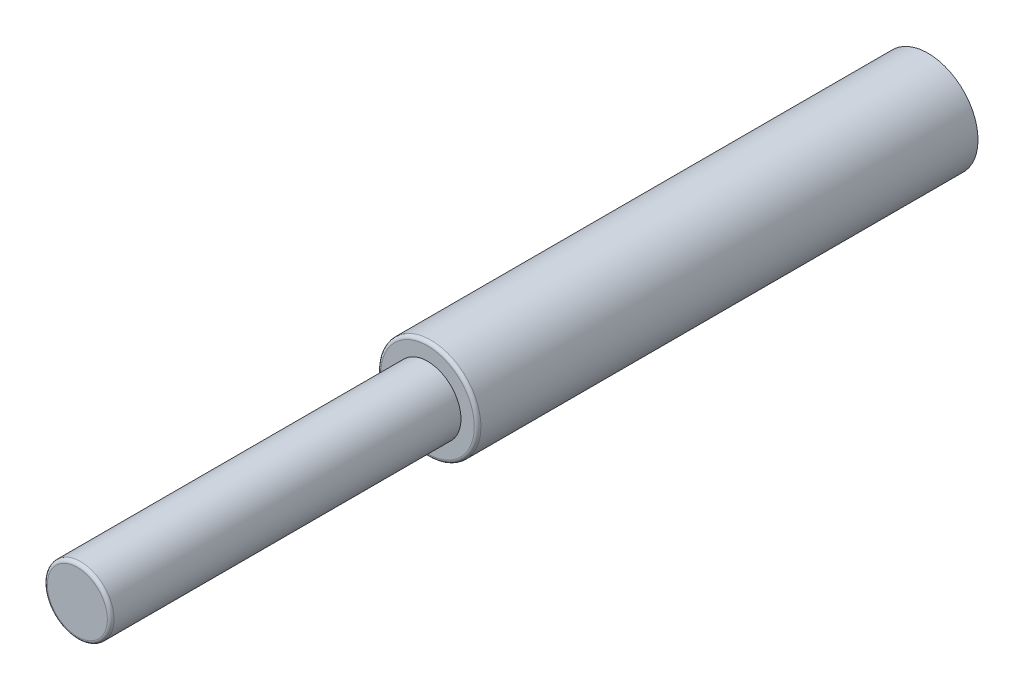
ISO-10303-21;
HEADER;
FILE_DESCRIPTION(('STEP AP214'),'2;1');
FILE_NAME('part.step','',(''),(''),'','','');
FILE_SCHEMA(('AUTOMOTIVE_DESIGN { 1 0 10303 214 1 1 1 1 }'));
ENDSEC;
DATA;
#1=APPLICATION_CONTEXT('core data for automotive mechanical design processes');
#2=APPLICATION_PROTOCOL_DEFINITION('international standard','automotive_design',2000,#1);
#3=PRODUCT_CONTEXT('',#1,'mechanical');
#4=PRODUCT('Part','Part','',(#3));
#5=PRODUCT_RELATED_PRODUCT_CATEGORY('part','',(#4));
#6=PRODUCT_DEFINITION_FORMATION('','',#4);
#7=PRODUCT_DEFINITION_CONTEXT('part definition',#1,'design');
#8=PRODUCT_DEFINITION('design','',#6,#7);
#9=PRODUCT_DEFINITION_SHAPE('','',#8);
#10=(LENGTH_UNIT() NAMED_UNIT(*) SI_UNIT(.MILLI.,.METRE.));
#11=(NAMED_UNIT(*) PLANE_ANGLE_UNIT() SI_UNIT($,.RADIAN.));
#12=(NAMED_UNIT(*) SI_UNIT($,.STERADIAN.) SOLID_ANGLE_UNIT());
#13=UNCERTAINTY_MEASURE_WITH_UNIT(LENGTH_MEASURE(1.E-05),#10,'distance_accuracy_value','');
#14=(GEOMETRIC_REPRESENTATION_CONTEXT(3) GLOBAL_UNCERTAINTY_ASSIGNED_CONTEXT((#13)) GLOBAL_UNIT_ASSIGNED_CONTEXT((#10,
#11,#12)) REPRESENTATION_CONTEXT('',''));
#15=CARTESIAN_POINT('',(0.,0.,0.));
#16=DIRECTION('',(0.,0.,1.));
#17=DIRECTION('',(1.,0.,0.));
#18=AXIS2_PLACEMENT_3D('',#15,#16,#17);
#19=CARTESIAN_POINT('',(0.,0.,300.));
#20=DIRECTION('',(0.,0.,-1.));
#21=DIRECTION('',(-1.,0.,0.));
#22=AXIS2_PLACEMENT_3D('',#19,#20,#21);
#23=CYLINDRICAL_SURFACE('',#22,30.);
#24=CARTESIAN_POINT('',(0.,0.,298.));
#25=DIRECTION('',(0.,0.,1.));
#26=DIRECTION('',(1.,0.,0.));
#27=AXIS2_PLACEMENT_3D('',#24,#25,#26);
#28=CIRCLE('',#27,30.);
#29=CARTESIAN_POINT('',(30.,0.,298.));
#30=VERTEX_POINT('',#29);
#31=EDGE_CURVE('E10',#30,#30,#28,.F.);
#32=ORIENTED_EDGE('',*,*,#31,.T.);
#33=EDGE_LOOP('',(#32));
#34=FACE_BOUND('',#33,.T.);
#35=CARTESIAN_POINT('',(0.,0.,0.));
#36=DIRECTION('',(0.,0.,1.));
#37=DIRECTION('',(1.,0.,0.));
#38=AXIS2_PLACEMENT_3D('',#35,#36,#37);
#39=CIRCLE('',#38,30.);
#40=CARTESIAN_POINT('',(30.,0.,0.));
#41=VERTEX_POINT('',#40);
#42=EDGE_CURVE('E62',#41,#41,#39,.T.);
#43=ORIENTED_EDGE('',*,*,#42,.T.);
#44=EDGE_LOOP('',(#43));
#45=FACE_BOUND('',#44,.T.);
#46=ADVANCED_FACE('F37',(#34,#45),#23,.T.);
#47=CARTESIAN_POINT('',(0.,0.,300.));
#48=DIRECTION('',(0.,0.,1.));
#49=DIRECTION('',(1.,0.,0.));
#50=AXIS2_PLACEMENT_3D('',#47,#48,#49);
#51=PLANE('',#50);
#52=CARTESIAN_POINT('',(0.,0.,300.));
#53=DIRECTION('',(0.,0.,1.));
#54=DIRECTION('',(1.,0.,0.));
#55=AXIS2_PLACEMENT_3D('',#52,#53,#54);
#56=CIRCLE('',#55,28.);
#57=CARTESIAN_POINT('',(28.,0.,300.));
#58=VERTEX_POINT('',#57);
#59=EDGE_CURVE('E45',#58,#58,#56,.T.);
#60=ORIENTED_EDGE('',*,*,#59,.T.);
#61=EDGE_LOOP('',(#60));
#62=FACE_BOUND('',#61,.T.);
#63=CARTESIAN_POINT('',(0.,0.,300.));
#64=DIRECTION('',(0.,0.,1.));
#65=DIRECTION('',(1.,0.,0.));
#66=AXIS2_PLACEMENT_3D('',#63,#64,#65);
#67=CIRCLE('',#66,20.);
#68=CARTESIAN_POINT('',(20.,0.,300.));
#69=VERTEX_POINT('',#68);
#70=EDGE_CURVE('E61',#69,#69,#67,.T.);
#71=ORIENTED_EDGE('',*,*,#70,.F.);
#72=EDGE_LOOP('',(#71));
#73=FACE_BOUND('',#72,.T.);
#74=ADVANCED_FACE('F72',(#62,#73),#51,.T.);
#75=CARTESIAN_POINT('',(0.,0.,0.));
#76=DIRECTION('',(0.,0.,1.));
#77=DIRECTION('',(1.,0.,0.));
#78=AXIS2_PLACEMENT_3D('',#75,#76,#77);
#79=PLANE('',#78);
#80=ORIENTED_EDGE('',*,*,#42,.F.);
#81=EDGE_LOOP('',(#80));
#82=FACE_BOUND('',#81,.T.);
#83=ADVANCED_FACE('F74',(#82),#79,.F.);
#84=CARTESIAN_POINT('',(0.,0.,510.));
#85=DIRECTION('',(0.,0.,-1.));
#86=DIRECTION('',(-1.,0.,0.));
#87=AXIS2_PLACEMENT_3D('',#84,#85,#86);
#88=CYLINDRICAL_SURFACE('',#87,20.);
#89=CARTESIAN_POINT('',(0.,0.,508.));
#90=DIRECTION('',(0.,0.,1.));
#91=DIRECTION('',(1.,0.,0.));
#92=AXIS2_PLACEMENT_3D('',#89,#90,#91);
#93=CIRCLE('',#92,20.);
#94=CARTESIAN_POINT('',(20.,0.,508.));
#95=VERTEX_POINT('',#94);
#96=EDGE_CURVE('E50',#95,#95,#93,.F.);
#97=ORIENTED_EDGE('',*,*,#96,.T.);
#98=EDGE_LOOP('',(#97));
#99=FACE_BOUND('',#98,.T.);
#100=ORIENTED_EDGE('',*,*,#70,.T.);
#101=EDGE_LOOP('',(#100));
#102=FACE_BOUND('',#101,.T.);
#103=ADVANCED_FACE('F70',(#99,#102),#88,.T.);
#104=CARTESIAN_POINT('',(0.,0.,510.));
#105=DIRECTION('',(0.,0.,1.));
#106=DIRECTION('',(1.,0.,0.));
#107=AXIS2_PLACEMENT_3D('',#104,#105,#106);
#108=PLANE('',#107);
#109=CARTESIAN_POINT('',(0.,0.,510.));
#110=DIRECTION('',(0.,0.,1.));
#111=DIRECTION('',(1.,0.,0.));
#112=AXIS2_PLACEMENT_3D('',#109,#110,#111);
#113=CIRCLE('',#112,18.);
#114=CARTESIAN_POINT('',(18.,0.,510.));
#115=VERTEX_POINT('',#114);
#116=EDGE_CURVE('E55',#115,#115,#113,.T.);
#117=ORIENTED_EDGE('',*,*,#116,.T.);
#118=EDGE_LOOP('',(#117));
#119=FACE_BOUND('',#118,.T.);
#120=ADVANCED_FACE('F87',(#119),#108,.T.);
#121=CARTESIAN_POINT('',(0.,0.,508.));
#122=DIRECTION('',(0.,0.,1.));
#123=DIRECTION('',(1.,0.,0.));
#124=AXIS2_PLACEMENT_3D('',#121,#122,#123);
#125=TOROIDAL_SURFACE('',#124,18.,2.);
#126=ORIENTED_EDGE('',*,*,#96,.F.);
#127=EDGE_LOOP('',(#126));
#128=FACE_BOUND('',#127,.T.);
#129=ORIENTED_EDGE('',*,*,#116,.F.);
#130=EDGE_LOOP('',(#129));
#131=FACE_BOUND('',#130,.T.);
#132=ADVANCED_FACE('F85',(#128,#131),#125,.T.);
#133=CARTESIAN_POINT('',(0.,0.,298.));
#134=DIRECTION('',(0.,0.,1.));
#135=DIRECTION('',(1.,0.,0.));
#136=AXIS2_PLACEMENT_3D('',#133,#134,#135);
#137=TOROIDAL_SURFACE('',#136,28.,2.);
#138=ORIENTED_EDGE('',*,*,#31,.F.);
#139=EDGE_LOOP('',(#138));
#140=FACE_BOUND('',#139,.T.);
#141=ORIENTED_EDGE('',*,*,#59,.F.);
#142=EDGE_LOOP('',(#141));
#143=FACE_BOUND('',#142,.T.);
#144=ADVANCED_FACE('F39',(#140,#143),#137,.T.);
#145=CLOSED_SHELL('',(#46,#74,#83,#103,#120,#132,#144));
#146=MANIFOLD_SOLID_BREP('B2',#145);
#147=ADVANCED_BREP_SHAPE_REPRESENTATION('',(#18,#146),#14);
#148=SHAPE_DEFINITION_REPRESENTATION(#9,#147);
ENDSEC;
END-ISO-10303-21;
